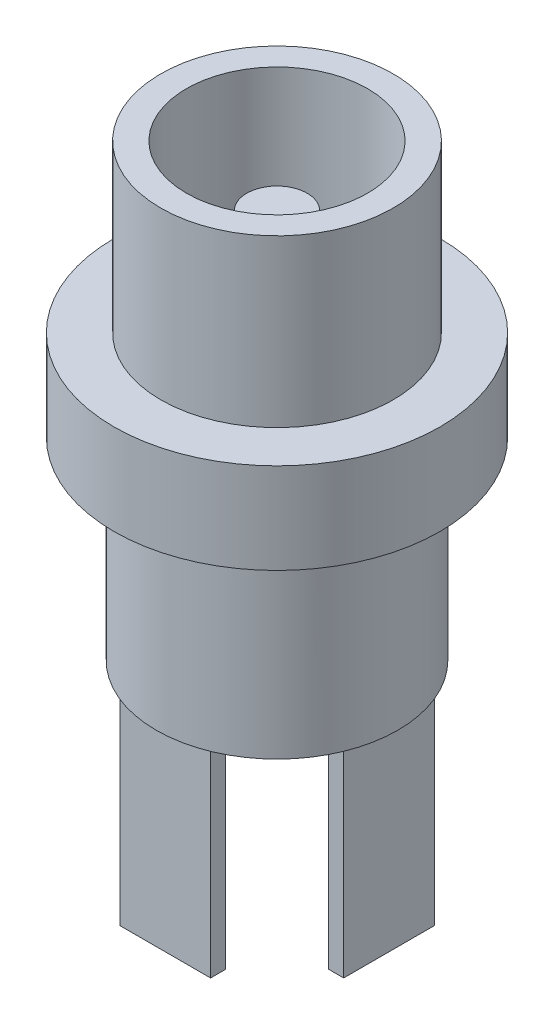
ISO-10303-21;
HEADER;
FILE_DESCRIPTION(('STEP AP214'),'2;1');
FILE_NAME('part.step','',(''),(''),'','','');
FILE_SCHEMA(('AUTOMOTIVE_DESIGN { 1 0 10303 214 1 1 1 1 }'));
ENDSEC;
DATA;
#1=APPLICATION_CONTEXT('core data for automotive mechanical design processes');
#2=APPLICATION_PROTOCOL_DEFINITION('international standard','automotive_design',2000,#1);
#3=PRODUCT_CONTEXT('',#1,'mechanical');
#4=PRODUCT('Part','Part','',(#3));
#5=PRODUCT_RELATED_PRODUCT_CATEGORY('part','',(#4));
#6=PRODUCT_DEFINITION_FORMATION('','',#4);
#7=PRODUCT_DEFINITION_CONTEXT('part definition',#1,'design');
#8=PRODUCT_DEFINITION('design','',#6,#7);
#9=PRODUCT_DEFINITION_SHAPE('','',#8);
#10=(LENGTH_UNIT() NAMED_UNIT(*) SI_UNIT(.MILLI.,.METRE.));
#11=(NAMED_UNIT(*) PLANE_ANGLE_UNIT() SI_UNIT($,.RADIAN.));
#12=(NAMED_UNIT(*) SI_UNIT($,.STERADIAN.) SOLID_ANGLE_UNIT());
#13=UNCERTAINTY_MEASURE_WITH_UNIT(LENGTH_MEASURE(1.E-05),#10,'distance_accuracy_value','');
#14=(GEOMETRIC_REPRESENTATION_CONTEXT(3) GLOBAL_UNCERTAINTY_ASSIGNED_CONTEXT((#13)) GLOBAL_UNIT_ASSIGNED_CONTEXT((#10,
#11,#12)) REPRESENTATION_CONTEXT('',''));
#15=CARTESIAN_POINT('',(0.,0.,0.));
#16=DIRECTION('',(0.,0.,1.));
#17=DIRECTION('',(1.,0.,0.));
#18=AXIS2_PLACEMENT_3D('',#15,#16,#17);
#19=CARTESIAN_POINT('',(0.,-1.5,0.));
#20=DIRECTION('',(0.,1.,0.));
#21=DIRECTION('',(0.,0.,1.));
#22=AXIS2_PLACEMENT_3D('',#19,#20,#21);
#23=PLANE('',#22);
#24=CARTESIAN_POINT('',(0.,-1.5,0.));
#25=DIRECTION('',(0.,1.,0.));
#26=DIRECTION('',(0.,0.,1.));
#27=AXIS2_PLACEMENT_3D('',#24,#25,#26);
#28=CIRCLE('',#27,3.);
#29=CARTESIAN_POINT('',(0.,-1.5,3.));
#30=VERTEX_POINT('',#29);
#31=EDGE_CURVE('E344',#30,#30,#28,.T.);
#32=ORIENTED_EDGE('',*,*,#31,.T.);
#33=EDGE_LOOP('',(#32));
#34=FACE_BOUND('',#33,.T.);
#35=CARTESIAN_POINT('',(0.,-1.5,0.));
#36=DIRECTION('',(0.,1.,0.));
#37=DIRECTION('',(0.,0.,1.));
#38=AXIS2_PLACEMENT_3D('',#35,#36,#37);
#39=CIRCLE('',#38,1.);
#40=CARTESIAN_POINT('',(0.,-1.5,1.));
#41=VERTEX_POINT('',#40);
#42=EDGE_CURVE('E352',#41,#41,#39,.T.);
#43=ORIENTED_EDGE('',*,*,#42,.F.);
#44=EDGE_LOOP('',(#43));
#45=FACE_BOUND('',#44,.T.);
#46=ADVANCED_FACE('F33',(#34,#45),#23,.T.);
#47=CARTESIAN_POINT('',(0.,-6.4,0.));
#48=DIRECTION('',(0.,-1.,0.));
#49=DIRECTION('',(0.,0.,-1.));
#50=AXIS2_PLACEMENT_3D('',#47,#48,#49);
#51=PLANE('',#50);
#52=CARTESIAN_POINT('',(0.,-6.4,0.));
#53=DIRECTION('',(0.,-1.,0.));
#54=DIRECTION('',(0.,0.,-1.));
#55=AXIS2_PLACEMENT_3D('',#52,#53,#54);
#56=CIRCLE('',#55,4.);
#57=CARTESIAN_POINT('',(3.70809924354783,-6.4,-1.5));
#58=VERTEX_POINT('',#57);
#59=CARTESIAN_POINT('',(3.70809924354783,-6.4,1.5));
#60=VERTEX_POINT('',#59);
#61=EDGE_CURVE('E209',#58,#60,#56,.T.);
#62=ORIENTED_EDGE('',*,*,#61,.T.);
#63=DIRECTION('',(0.,0.,1.));
#64=VECTOR('',#63,1.);
#65=CARTESIAN_POINT('',(3.70809924354783,-6.4,-1.5));
#66=LINE('',#65,#64);
#67=EDGE_CURVE('E146',#58,#60,#66,.T.);
#68=ORIENTED_EDGE('',*,*,#67,.F.);
#69=EDGE_LOOP('',(#62,#68));
#70=FACE_BOUND('',#69,.T.);
#71=ADVANCED_FACE('F250',(#70),#51,.T.);
#72=DIRECTION('',(0.,0.,-1.));
#73=VECTOR('',#72,1.);
#74=CARTESIAN_POINT('',(-1.49487014813232,-6.4,3.70360695690408));
#75=LINE('',#74,#73);
#76=CARTESIAN_POINT('',(-1.49487014813232,-6.4,3.70360695690408));
#77=VERTEX_POINT('',#76);
#78=CARTESIAN_POINT('',(-1.49487014813232,-6.4,3.20360695690408));
#79=VERTEX_POINT('',#78);
#80=EDGE_CURVE('E151',#77,#79,#75,.T.);
#81=ORIENTED_EDGE('',*,*,#80,.F.);
#82=DIRECTION('',(-1.,0.,0.));
#83=VECTOR('',#82,1.);
#84=CARTESIAN_POINT('',(-1.49487014813232,-6.4,3.70360695690408));
#85=LINE('',#84,#83);
#86=CARTESIAN_POINT('',(1.50512985186768,-6.4,3.70360695690408));
#87=VERTEX_POINT('',#86);
#88=EDGE_CURVE('E148',#87,#77,#85,.T.);
#89=ORIENTED_EDGE('',*,*,#88,.F.);
#90=DIRECTION('',(0.,0.,1.));
#91=VECTOR('',#90,1.);
#92=CARTESIAN_POINT('',(1.50512985186768,-6.4,3.70360695690408));
#93=LINE('',#92,#91);
#94=CARTESIAN_POINT('',(1.50512985186768,-6.4,3.20360695690408));
#95=VERTEX_POINT('',#94);
#96=EDGE_CURVE('E160',#95,#87,#93,.T.);
#97=ORIENTED_EDGE('',*,*,#96,.F.);
#98=DIRECTION('',(1.,0.,0.));
#99=VECTOR('',#98,1.);
#100=CARTESIAN_POINT('',(-1.49487014813232,-6.4,3.20360695690408));
#101=LINE('',#100,#99);
#102=EDGE_CURVE('E168',#79,#95,#101,.T.);
#103=ORIENTED_EDGE('',*,*,#102,.F.);
#104=EDGE_LOOP('',(#81,#89,#97,#103));
#105=FACE_BOUND('',#104,.T.);
#106=DIRECTION('',(1.,0.,0.));
#107=VECTOR('',#106,1.);
#108=CARTESIAN_POINT('',(-1.49487014813232,-6.4,-3.70360695690408));
#109=LINE('',#108,#107);
#110=CARTESIAN_POINT('',(-1.49487014813232,-6.4,-3.70360695690408));
#111=VERTEX_POINT('',#110);
#112=CARTESIAN_POINT('',(1.50512985186768,-6.4,-3.70360695690408));
#113=VERTEX_POINT('',#112);
#114=EDGE_CURVE('E193',#111,#113,#109,.T.);
#115=ORIENTED_EDGE('',*,*,#114,.F.);
#116=DIRECTION('',(0.,0.,-1.));
#117=VECTOR('',#116,1.);
#118=CARTESIAN_POINT('',(-1.49487014813232,-6.4,-3.70360695690408));
#119=LINE('',#118,#117);
#120=CARTESIAN_POINT('',(-1.49487014813232,-6.4,-3.20360695690408));
#121=VERTEX_POINT('',#120);
#122=EDGE_CURVE('E179',#121,#111,#119,.T.);
#123=ORIENTED_EDGE('',*,*,#122,.F.);
#124=DIRECTION('',(-1.,0.,0.));
#125=VECTOR('',#124,1.);
#126=CARTESIAN_POINT('',(-1.49487014813232,-6.4,-3.20360695690408));
#127=LINE('',#126,#125);
#128=CARTESIAN_POINT('',(1.50512985186768,-6.4,-3.20360695690408));
#129=VERTEX_POINT('',#128);
#130=EDGE_CURVE('E184',#129,#121,#127,.T.);
#131=ORIENTED_EDGE('',*,*,#130,.F.);
#132=DIRECTION('',(0.,0.,1.));
#133=VECTOR('',#132,1.);
#134=CARTESIAN_POINT('',(1.50512985186768,-6.4,-3.70360695690408));
#135=LINE('',#134,#133);
#136=EDGE_CURVE('E195',#113,#129,#135,.T.);
#137=ORIENTED_EDGE('',*,*,#136,.F.);
#138=EDGE_LOOP('',(#115,#123,#131,#137));
#139=FACE_BOUND('',#138,.T.);
#140=DIRECTION('',(0.,0.,-1.));
#141=VECTOR('',#140,1.);
#142=CARTESIAN_POINT('',(3.20809924354783,-6.4,-1.5));
#143=LINE('',#142,#141);
#144=CARTESIAN_POINT('',(3.20809924354783,-6.4,1.5));
#145=VERTEX_POINT('',#144);
#146=CARTESIAN_POINT('',(3.20809924354783,-6.4,-1.5));
#147=VERTEX_POINT('',#146);
#148=EDGE_CURVE('E332',#145,#147,#143,.T.);
#149=ORIENTED_EDGE('',*,*,#148,.F.);
#150=DIRECTION('',(-1.,0.,0.));
#151=VECTOR('',#150,1.);
#152=CARTESIAN_POINT('',(3.70809924354783,-6.4,1.5));
#153=LINE('',#152,#151);
#154=EDGE_CURVE('E334',#60,#145,#153,.T.);
#155=ORIENTED_EDGE('',*,*,#154,.F.);
#156=EDGE_CURVE('E208',#60,#58,#56,.T.);
#157=ORIENTED_EDGE('',*,*,#156,.T.);
#158=DIRECTION('',(1.,0.,0.));
#159=VECTOR('',#158,1.);
#160=CARTESIAN_POINT('',(3.70809924354783,-6.4,-1.5));
#161=LINE('',#160,#159);
#162=EDGE_CURVE('E142',#147,#58,#161,.T.);
#163=ORIENTED_EDGE('',*,*,#162,.F.);
#164=EDGE_LOOP('',(#149,#155,#157,#163));
#165=FACE_BOUND('',#164,.T.);
#166=ADVANCED_FACE('F228',(#105,#139,#165),#51,.T.);
#167=CARTESIAN_POINT('',(0.,0.,0.));
#168=DIRECTION('',(0.,1.,0.));
#169=DIRECTION('',(0.,0.,1.));
#170=AXIS2_PLACEMENT_3D('',#167,#168,#169);
#171=PLANE('',#170);
#172=CARTESIAN_POINT('',(0.,0.,0.));
#173=DIRECTION('',(0.,1.,0.));
#174=DIRECTION('',(0.,0.,1.));
#175=AXIS2_PLACEMENT_3D('',#172,#173,#174);
#176=CIRCLE('',#175,5.4);
#177=CARTESIAN_POINT('',(0.,0.,5.4));
#178=VERTEX_POINT('',#177);
#179=EDGE_CURVE('E216',#178,#178,#176,.T.);
#180=ORIENTED_EDGE('',*,*,#179,.F.);
#181=EDGE_LOOP('',(#180));
#182=FACE_BOUND('',#181,.T.);
#183=CARTESIAN_POINT('',(0.,0.,0.));
#184=DIRECTION('',(0.,1.,0.));
#185=DIRECTION('',(0.,0.,1.));
#186=AXIS2_PLACEMENT_3D('',#183,#184,#185);
#187=CIRCLE('',#186,4.);
#188=CARTESIAN_POINT('',(0.,0.,4.));
#189=VERTEX_POINT('',#188);
#190=EDGE_CURVE('E11',#189,#189,#187,.F.);
#191=ORIENTED_EDGE('',*,*,#190,.F.);
#192=EDGE_LOOP('',(#191));
#193=FACE_BOUND('',#192,.T.);
#194=ADVANCED_FACE('F224',(#182,#193),#171,.F.);
#195=CARTESIAN_POINT('',(0.,3.,0.));
#196=DIRECTION('',(0.,1.,0.));
#197=DIRECTION('',(0.,0.,1.));
#198=AXIS2_PLACEMENT_3D('',#195,#196,#197);
#199=PLANE('',#198);
#200=CARTESIAN_POINT('',(0.,3.,0.));
#201=DIRECTION('',(0.,1.,0.));
#202=DIRECTION('',(0.,0.,1.));
#203=AXIS2_PLACEMENT_3D('',#200,#201,#202);
#204=CIRCLE('',#203,5.4);
#205=CARTESIAN_POINT('',(0.,3.,5.4));
#206=VERTEX_POINT('',#205);
#207=EDGE_CURVE('E41',#206,#206,#204,.T.);
#208=ORIENTED_EDGE('',*,*,#207,.T.);
#209=EDGE_LOOP('',(#208));
#210=FACE_BOUND('',#209,.T.);
#211=CARTESIAN_POINT('',(0.,3.,0.));
#212=DIRECTION('',(0.,1.,0.));
#213=DIRECTION('',(0.,0.,1.));
#214=AXIS2_PLACEMENT_3D('',#211,#212,#213);
#215=CIRCLE('',#214,3.85);
#216=CARTESIAN_POINT('',(0.,3.,3.85));
#217=VERTEX_POINT('',#216);
#218=EDGE_CURVE('E212',#217,#217,#215,.T.);
#219=ORIENTED_EDGE('',*,*,#218,.F.);
#220=EDGE_LOOP('',(#219));
#221=FACE_BOUND('',#220,.T.);
#222=ADVANCED_FACE('F227',(#210,#221),#199,.T.);
#223=CARTESIAN_POINT('',(0.,3.,0.));
#224=DIRECTION('',(0.,-1.,0.));
#225=DIRECTION('',(0.,0.,-1.));
#226=AXIS2_PLACEMENT_3D('',#223,#224,#225);
#227=CYLINDRICAL_SURFACE('',#226,5.4);
#228=ORIENTED_EDGE('',*,*,#207,.F.);
#229=EDGE_LOOP('',(#228));
#230=FACE_BOUND('',#229,.T.);
#231=ORIENTED_EDGE('',*,*,#179,.T.);
#232=EDGE_LOOP('',(#231));
#233=FACE_BOUND('',#232,.T.);
#234=ADVANCED_FACE('F35',(#230,#233),#227,.T.);
#235=CARTESIAN_POINT('',(0.,8.5,0.));
#236=DIRECTION('',(0.,-1.,0.));
#237=DIRECTION('',(0.,0.,-1.));
#238=AXIS2_PLACEMENT_3D('',#235,#236,#237);
#239=CYLINDRICAL_SURFACE('',#238,3.85);
#240=CARTESIAN_POINT('',(0.,8.5,0.));
#241=DIRECTION('',(0.,1.,0.));
#242=DIRECTION('',(0.,0.,1.));
#243=AXIS2_PLACEMENT_3D('',#240,#241,#242);
#244=CIRCLE('',#243,3.85);
#245=CARTESIAN_POINT('',(0.,8.5,3.85));
#246=VERTEX_POINT('',#245);
#247=EDGE_CURVE('E213',#246,#246,#244,.T.);
#248=ORIENTED_EDGE('',*,*,#247,.F.);
#249=EDGE_LOOP('',(#248));
#250=FACE_BOUND('',#249,.T.);
#251=ORIENTED_EDGE('',*,*,#218,.T.);
#252=EDGE_LOOP('',(#251));
#253=FACE_BOUND('',#252,.T.);
#254=ADVANCED_FACE('F244',(#250,#253),#239,.T.);
#255=CARTESIAN_POINT('',(0.,8.5,0.));
#256=DIRECTION('',(0.,1.,0.));
#257=DIRECTION('',(0.,0.,1.));
#258=AXIS2_PLACEMENT_3D('',#255,#256,#257);
#259=PLANE('',#258);
#260=CARTESIAN_POINT('',(0.,8.5,0.));
#261=DIRECTION('',(0.,1.,0.));
#262=DIRECTION('',(0.,0.,1.));
#263=AXIS2_PLACEMENT_3D('',#260,#261,#262);
#264=CIRCLE('',#263,3.);
#265=CARTESIAN_POINT('',(0.,8.5,3.));
#266=VERTEX_POINT('',#265);
#267=EDGE_CURVE('E345',#266,#266,#264,.T.);
#268=ORIENTED_EDGE('',*,*,#267,.F.);
#269=EDGE_LOOP('',(#268));
#270=FACE_BOUND('',#269,.T.);
#271=ORIENTED_EDGE('',*,*,#247,.T.);
#272=EDGE_LOOP('',(#271));
#273=FACE_BOUND('',#272,.T.);
#274=ADVANCED_FACE('F234',(#270,#273),#259,.T.);
#275=CARTESIAN_POINT('',(0.,-6.4,0.));
#276=DIRECTION('',(0.,1.,0.));
#277=DIRECTION('',(0.,0.,1.));
#278=AXIS2_PLACEMENT_3D('',#275,#276,#277);
#279=CYLINDRICAL_SURFACE('',#278,4.);
#280=ORIENTED_EDGE('',*,*,#61,.F.);
#281=ORIENTED_EDGE('',*,*,#156,.F.);
#282=EDGE_LOOP('',(#280,#281));
#283=FACE_BOUND('',#282,.T.);
#284=ORIENTED_EDGE('',*,*,#190,.T.);
#285=EDGE_LOOP('',(#284));
#286=FACE_BOUND('',#285,.T.);
#287=ADVANCED_FACE('F231',(#283,#286),#279,.T.);
#288=CARTESIAN_POINT('',(-1.49487014813232,-12.9,-3.70360695690408));
#289=DIRECTION('',(1.,0.,0.));
#290=DIRECTION('',(0.,0.,-1.));
#291=AXIS2_PLACEMENT_3D('',#288,#289,#290);
#292=PLANE('',#291);
#293=ORIENTED_EDGE('',*,*,#122,.T.);
#294=DIRECTION('',(0.,1.,0.));
#295=VECTOR('',#294,1.);
#296=CARTESIAN_POINT('',(-1.49487014813232,-12.9,-3.70360695690408));
#297=LINE('',#296,#295);
#298=CARTESIAN_POINT('',(-1.49487014813232,-12.9,-3.70360695690408));
#299=VERTEX_POINT('',#298);
#300=EDGE_CURVE('E206',#299,#111,#297,.T.);
#301=ORIENTED_EDGE('',*,*,#300,.F.);
#302=DIRECTION('',(0.,0.,-1.));
#303=VECTOR('',#302,1.);
#304=CARTESIAN_POINT('',(-1.49487014813232,-12.9,-3.70360695690408));
#305=LINE('',#304,#303);
#306=CARTESIAN_POINT('',(-1.49487014813232,-12.9,-3.20360695690408));
#307=VERTEX_POINT('',#306);
#308=EDGE_CURVE('E180',#307,#299,#305,.T.);
#309=ORIENTED_EDGE('',*,*,#308,.F.);
#310=DIRECTION('',(0.,1.,0.));
#311=VECTOR('',#310,1.);
#312=CARTESIAN_POINT('',(-1.49487014813232,-12.9,-3.20360695690408));
#313=LINE('',#312,#311);
#314=EDGE_CURVE('E190',#307,#121,#313,.T.);
#315=ORIENTED_EDGE('',*,*,#314,.T.);
#316=EDGE_LOOP('',(#293,#301,#309,#315));
#317=FACE_BOUND('',#316,.T.);
#318=ADVANCED_FACE('F233',(#317),#292,.F.);
#319=CARTESIAN_POINT('',(-1.49487014813232,-12.9,-3.70360695690408));
#320=DIRECTION('',(0.,0.,1.));
#321=DIRECTION('',(1.,0.,0.));
#322=AXIS2_PLACEMENT_3D('',#319,#320,#321);
#323=PLANE('',#322);
#324=ORIENTED_EDGE('',*,*,#114,.T.);
#325=DIRECTION('',(0.,1.,0.));
#326=VECTOR('',#325,1.);
#327=CARTESIAN_POINT('',(1.50512985186768,-12.9,-3.70360695690408));
#328=LINE('',#327,#326);
#329=CARTESIAN_POINT('',(1.50512985186768,-12.9,-3.70360695690408));
#330=VERTEX_POINT('',#329);
#331=EDGE_CURVE('E203',#330,#113,#328,.T.);
#332=ORIENTED_EDGE('',*,*,#331,.F.);
#333=DIRECTION('',(1.,0.,0.));
#334=VECTOR('',#333,1.);
#335=CARTESIAN_POINT('',(-1.49487014813232,-12.9,-3.70360695690408));
#336=LINE('',#335,#334);
#337=EDGE_CURVE('E183',#299,#330,#336,.T.);
#338=ORIENTED_EDGE('',*,*,#337,.F.);
#339=ORIENTED_EDGE('',*,*,#300,.T.);
#340=EDGE_LOOP('',(#324,#332,#338,#339));
#341=FACE_BOUND('',#340,.T.);
#342=ADVANCED_FACE('F241',(#341),#323,.F.);
#343=CARTESIAN_POINT('',(1.50512985186768,-12.9,-3.70360695690408));
#344=DIRECTION('',(-1.,0.,0.));
#345=DIRECTION('',(0.,0.,1.));
#346=AXIS2_PLACEMENT_3D('',#343,#344,#345);
#347=PLANE('',#346);
#348=ORIENTED_EDGE('',*,*,#136,.T.);
#349=DIRECTION('',(0.,1.,0.));
#350=VECTOR('',#349,1.);
#351=CARTESIAN_POINT('',(1.50512985186768,-12.9,-3.20360695690408));
#352=LINE('',#351,#350);
#353=CARTESIAN_POINT('',(1.50512985186768,-12.9,-3.20360695690408));
#354=VERTEX_POINT('',#353);
#355=EDGE_CURVE('E201',#354,#129,#352,.T.);
#356=ORIENTED_EDGE('',*,*,#355,.F.);
#357=DIRECTION('',(0.,0.,1.));
#358=VECTOR('',#357,1.);
#359=CARTESIAN_POINT('',(1.50512985186768,-12.9,-3.70360695690408));
#360=LINE('',#359,#358);
#361=EDGE_CURVE('E186',#330,#354,#360,.T.);
#362=ORIENTED_EDGE('',*,*,#361,.F.);
#363=ORIENTED_EDGE('',*,*,#331,.T.);
#364=EDGE_LOOP('',(#348,#356,#362,#363));
#365=FACE_BOUND('',#364,.T.);
#366=ADVANCED_FACE('F306',(#365),#347,.F.);
#367=CARTESIAN_POINT('',(-1.49487014813232,-12.9,-3.20360695690408));
#368=DIRECTION('',(0.,0.,-1.));
#369=DIRECTION('',(-1.,0.,0.));
#370=AXIS2_PLACEMENT_3D('',#367,#368,#369);
#371=PLANE('',#370);
#372=ORIENTED_EDGE('',*,*,#130,.T.);
#373=ORIENTED_EDGE('',*,*,#314,.F.);
#374=DIRECTION('',(-1.,0.,0.));
#375=VECTOR('',#374,1.);
#376=CARTESIAN_POINT('',(-1.49487014813232,-12.9,-3.20360695690408));
#377=LINE('',#376,#375);
#378=EDGE_CURVE('E188',#354,#307,#377,.T.);
#379=ORIENTED_EDGE('',*,*,#378,.F.);
#380=ORIENTED_EDGE('',*,*,#355,.T.);
#381=EDGE_LOOP('',(#372,#373,#379,#380));
#382=FACE_BOUND('',#381,.T.);
#383=ADVANCED_FACE('F302',(#382),#371,.F.);
#384=CARTESIAN_POINT('',(0.,-12.9,0.));
#385=DIRECTION('',(0.,1.,0.));
#386=DIRECTION('',(0.,0.,1.));
#387=AXIS2_PLACEMENT_3D('',#384,#385,#386);
#388=PLANE('',#387);
#389=ORIENTED_EDGE('',*,*,#308,.T.);
#390=ORIENTED_EDGE('',*,*,#337,.T.);
#391=ORIENTED_EDGE('',*,*,#361,.T.);
#392=ORIENTED_EDGE('',*,*,#378,.T.);
#393=EDGE_LOOP('',(#389,#390,#391,#392));
#394=FACE_BOUND('',#393,.T.);
#395=ADVANCED_FACE('F298',(#394),#388,.F.);
#396=CARTESIAN_POINT('',(-1.49487014813232,-12.9,3.70360695690408));
#397=DIRECTION('',(0.,0.,-1.));
#398=DIRECTION('',(-1.,0.,0.));
#399=AXIS2_PLACEMENT_3D('',#396,#397,#398);
#400=PLANE('',#399);
#401=ORIENTED_EDGE('',*,*,#88,.T.);
#402=DIRECTION('',(0.,1.,0.));
#403=VECTOR('',#402,1.);
#404=CARTESIAN_POINT('',(-1.49487014813232,-12.9,3.70360695690408));
#405=LINE('',#404,#403);
#406=CARTESIAN_POINT('',(-1.49487014813232,-12.9,3.70360695690408));
#407=VERTEX_POINT('',#406);
#408=EDGE_CURVE('E177',#407,#77,#405,.T.);
#409=ORIENTED_EDGE('',*,*,#408,.F.);
#410=DIRECTION('',(-1.,0.,0.));
#411=VECTOR('',#410,1.);
#412=CARTESIAN_POINT('',(-1.49487014813232,-12.9,3.70360695690408));
#413=LINE('',#412,#411);
#414=CARTESIAN_POINT('',(1.50512985186768,-12.9,3.70360695690408));
#415=VERTEX_POINT('',#414);
#416=EDGE_CURVE('E156',#415,#407,#413,.T.);
#417=ORIENTED_EDGE('',*,*,#416,.F.);
#418=DIRECTION('',(0.,1.,0.));
#419=VECTOR('',#418,1.);
#420=CARTESIAN_POINT('',(1.50512985186768,-12.9,3.70360695690408));
#421=LINE('',#420,#419);
#422=EDGE_CURVE('E165',#415,#87,#421,.T.);
#423=ORIENTED_EDGE('',*,*,#422,.T.);
#424=EDGE_LOOP('',(#401,#409,#417,#423));
#425=FACE_BOUND('',#424,.T.);
#426=ADVANCED_FACE('F294',(#425),#400,.F.);
#427=CARTESIAN_POINT('',(-1.49487014813232,-12.9,3.70360695690408));
#428=DIRECTION('',(1.,0.,0.));
#429=DIRECTION('',(0.,0.,-1.));
#430=AXIS2_PLACEMENT_3D('',#427,#428,#429);
#431=PLANE('',#430);
#432=ORIENTED_EDGE('',*,*,#80,.T.);
#433=DIRECTION('',(0.,1.,0.));
#434=VECTOR('',#433,1.);
#435=CARTESIAN_POINT('',(-1.49487014813232,-12.9,3.20360695690408));
#436=LINE('',#435,#434);
#437=CARTESIAN_POINT('',(-1.49487014813232,-12.9,3.20360695690408));
#438=VERTEX_POINT('',#437);
#439=EDGE_CURVE('E174',#438,#79,#436,.T.);
#440=ORIENTED_EDGE('',*,*,#439,.F.);
#441=DIRECTION('',(0.,0.,-1.));
#442=VECTOR('',#441,1.);
#443=CARTESIAN_POINT('',(-1.49487014813232,-12.9,3.70360695690408));
#444=LINE('',#443,#442);
#445=EDGE_CURVE('E159',#407,#438,#444,.T.);
#446=ORIENTED_EDGE('',*,*,#445,.F.);
#447=ORIENTED_EDGE('',*,*,#408,.T.);
#448=EDGE_LOOP('',(#432,#440,#446,#447));
#449=FACE_BOUND('',#448,.T.);
#450=ADVANCED_FACE('F290',(#449),#431,.F.);
#451=CARTESIAN_POINT('',(-1.49487014813232,-12.9,3.20360695690408));
#452=DIRECTION('',(0.,0.,1.));
#453=DIRECTION('',(1.,0.,0.));
#454=AXIS2_PLACEMENT_3D('',#451,#452,#453);
#455=PLANE('',#454);
#456=ORIENTED_EDGE('',*,*,#102,.T.);
#457=DIRECTION('',(0.,1.,0.));
#458=VECTOR('',#457,1.);
#459=CARTESIAN_POINT('',(1.50512985186768,-12.9,3.20360695690408));
#460=LINE('',#459,#458);
#461=CARTESIAN_POINT('',(1.50512985186768,-12.9,3.20360695690408));
#462=VERTEX_POINT('',#461);
#463=EDGE_CURVE('E56',#462,#95,#460,.T.);
#464=ORIENTED_EDGE('',*,*,#463,.F.);
#465=DIRECTION('',(1.,0.,0.));
#466=VECTOR('',#465,1.);
#467=CARTESIAN_POINT('',(-1.49487014813232,-12.9,3.20360695690408));
#468=LINE('',#467,#466);
#469=EDGE_CURVE('E162',#438,#462,#468,.T.);
#470=ORIENTED_EDGE('',*,*,#469,.F.);
#471=ORIENTED_EDGE('',*,*,#439,.T.);
#472=EDGE_LOOP('',(#456,#464,#470,#471));
#473=FACE_BOUND('',#472,.T.);
#474=ADVANCED_FACE('F287',(#473),#455,.F.);
#475=CARTESIAN_POINT('',(1.50512985186768,-12.9,3.70360695690408));
#476=DIRECTION('',(-1.,0.,0.));
#477=DIRECTION('',(0.,0.,1.));
#478=AXIS2_PLACEMENT_3D('',#475,#476,#477);
#479=PLANE('',#478);
#480=ORIENTED_EDGE('',*,*,#96,.T.);
#481=ORIENTED_EDGE('',*,*,#422,.F.);
#482=DIRECTION('',(0.,0.,1.));
#483=VECTOR('',#482,1.);
#484=CARTESIAN_POINT('',(1.50512985186768,-12.9,3.70360695690408));
#485=LINE('',#484,#483);
#486=EDGE_CURVE('E164',#462,#415,#485,.T.);
#487=ORIENTED_EDGE('',*,*,#486,.F.);
#488=ORIENTED_EDGE('',*,*,#463,.T.);
#489=EDGE_LOOP('',(#480,#481,#487,#488));
#490=FACE_BOUND('',#489,.T.);
#491=ADVANCED_FACE('F283',(#490),#479,.F.);
#492=CARTESIAN_POINT('',(0.,-12.9,0.));
#493=DIRECTION('',(0.,1.,0.));
#494=DIRECTION('',(0.,0.,1.));
#495=AXIS2_PLACEMENT_3D('',#492,#493,#494);
#496=PLANE('',#495);
#497=ORIENTED_EDGE('',*,*,#416,.T.);
#498=ORIENTED_EDGE('',*,*,#445,.T.);
#499=ORIENTED_EDGE('',*,*,#469,.T.);
#500=ORIENTED_EDGE('',*,*,#486,.T.);
#501=EDGE_LOOP('',(#497,#498,#499,#500));
#502=FACE_BOUND('',#501,.T.);
#503=ADVANCED_FACE('F280',(#502),#496,.F.);
#504=CARTESIAN_POINT('',(3.70809924354783,-12.9,-1.5));
#505=DIRECTION('',(-1.,0.,0.));
#506=DIRECTION('',(0.,0.,1.));
#507=AXIS2_PLACEMENT_3D('',#504,#505,#506);
#508=PLANE('',#507);
#509=ORIENTED_EDGE('',*,*,#67,.T.);
#510=DIRECTION('',(0.,1.,0.));
#511=VECTOR('',#510,1.);
#512=CARTESIAN_POINT('',(3.70809924354783,-12.9,1.5));
#513=LINE('',#512,#511);
#514=CARTESIAN_POINT('',(3.70809924354783,-12.9,1.5));
#515=VERTEX_POINT('',#514);
#516=EDGE_CURVE('E127',#515,#60,#513,.T.);
#517=ORIENTED_EDGE('',*,*,#516,.F.);
#518=DIRECTION('',(0.,0.,1.));
#519=VECTOR('',#518,1.);
#520=CARTESIAN_POINT('',(3.70809924354783,-12.9,-1.5));
#521=LINE('',#520,#519);
#522=CARTESIAN_POINT('',(3.70809924354783,-12.9,-1.5));
#523=VERTEX_POINT('',#522);
#524=EDGE_CURVE('E134',#523,#515,#521,.T.);
#525=ORIENTED_EDGE('',*,*,#524,.F.);
#526=DIRECTION('',(0.,1.,0.));
#527=VECTOR('',#526,1.);
#528=CARTESIAN_POINT('',(3.70809924354783,-12.9,-1.5));
#529=LINE('',#528,#527);
#530=EDGE_CURVE('E341',#523,#58,#529,.T.);
#531=ORIENTED_EDGE('',*,*,#530,.T.);
#532=EDGE_LOOP('',(#509,#517,#525,#531));
#533=FACE_BOUND('',#532,.T.);
#534=ADVANCED_FACE('F144',(#533),#508,.F.);
#535=CARTESIAN_POINT('',(3.70809924354783,-12.9,1.5));
#536=DIRECTION('',(0.,0.,-1.));
#537=DIRECTION('',(-1.,0.,0.));
#538=AXIS2_PLACEMENT_3D('',#535,#536,#537);
#539=PLANE('',#538);
#540=ORIENTED_EDGE('',*,*,#154,.T.);
#541=DIRECTION('',(0.,1.,0.));
#542=VECTOR('',#541,1.);
#543=CARTESIAN_POINT('',(3.20809924354783,-12.9,1.5));
#544=LINE('',#543,#542);
#545=CARTESIAN_POINT('',(3.20809924354783,-12.9,1.5));
#546=VERTEX_POINT('',#545);
#547=EDGE_CURVE('E130',#546,#145,#544,.T.);
#548=ORIENTED_EDGE('',*,*,#547,.F.);
#549=DIRECTION('',(-1.,0.,0.));
#550=VECTOR('',#549,1.);
#551=CARTESIAN_POINT('',(3.70809924354783,-12.9,1.5));
#552=LINE('',#551,#550);
#553=EDGE_CURVE('E123',#515,#546,#552,.T.);
#554=ORIENTED_EDGE('',*,*,#553,.F.);
#555=ORIENTED_EDGE('',*,*,#516,.T.);
#556=EDGE_LOOP('',(#540,#548,#554,#555));
#557=FACE_BOUND('',#556,.T.);
#558=ADVANCED_FACE('F125',(#557),#539,.F.);
#559=CARTESIAN_POINT('',(3.20809924354783,-12.9,-1.5));
#560=DIRECTION('',(1.,0.,0.));
#561=DIRECTION('',(0.,0.,-1.));
#562=AXIS2_PLACEMENT_3D('',#559,#560,#561);
#563=PLANE('',#562);
#564=ORIENTED_EDGE('',*,*,#148,.T.);
#565=DIRECTION('',(0.,1.,0.));
#566=VECTOR('',#565,1.);
#567=CARTESIAN_POINT('',(3.20809924354783,-12.9,-1.5));
#568=LINE('',#567,#566);
#569=CARTESIAN_POINT('',(3.20809924354783,-12.9,-1.5));
#570=VERTEX_POINT('',#569);
#571=EDGE_CURVE('E48',#570,#147,#568,.T.);
#572=ORIENTED_EDGE('',*,*,#571,.F.);
#573=DIRECTION('',(0.,0.,-1.));
#574=VECTOR('',#573,1.);
#575=CARTESIAN_POINT('',(3.20809924354783,-12.9,-1.5));
#576=LINE('',#575,#574);
#577=EDGE_CURVE('E133',#546,#570,#576,.T.);
#578=ORIENTED_EDGE('',*,*,#577,.F.);
#579=ORIENTED_EDGE('',*,*,#547,.T.);
#580=EDGE_LOOP('',(#564,#572,#578,#579));
#581=FACE_BOUND('',#580,.T.);
#582=ADVANCED_FACE('F272',(#581),#563,.F.);
#583=CARTESIAN_POINT('',(3.70809924354783,-12.9,-1.5));
#584=DIRECTION('',(0.,0.,1.));
#585=DIRECTION('',(1.,0.,0.));
#586=AXIS2_PLACEMENT_3D('',#583,#584,#585);
#587=PLANE('',#586);
#588=ORIENTED_EDGE('',*,*,#162,.T.);
#589=ORIENTED_EDGE('',*,*,#530,.F.);
#590=DIRECTION('',(1.,0.,0.));
#591=VECTOR('',#590,1.);
#592=CARTESIAN_POINT('',(3.70809924354783,-12.9,-1.5));
#593=LINE('',#592,#591);
#594=EDGE_CURVE('E138',#570,#523,#593,.T.);
#595=ORIENTED_EDGE('',*,*,#594,.F.);
#596=ORIENTED_EDGE('',*,*,#571,.T.);
#597=EDGE_LOOP('',(#588,#589,#595,#596));
#598=FACE_BOUND('',#597,.T.);
#599=ADVANCED_FACE('F269',(#598),#587,.F.);
#600=CARTESIAN_POINT('',(0.,-12.9,0.));
#601=DIRECTION('',(0.,-1.,0.));
#602=DIRECTION('',(0.,0.,-1.));
#603=AXIS2_PLACEMENT_3D('',#600,#601,#602);
#604=PLANE('',#603);
#605=ORIENTED_EDGE('',*,*,#524,.T.);
#606=ORIENTED_EDGE('',*,*,#553,.T.);
#607=ORIENTED_EDGE('',*,*,#577,.T.);
#608=ORIENTED_EDGE('',*,*,#594,.T.);
#609=EDGE_LOOP('',(#605,#606,#607,#608));
#610=FACE_BOUND('',#609,.T.);
#611=ADVANCED_FACE('F137',(#610),#604,.T.);
#612=CARTESIAN_POINT('',(0.,-1.5,0.));
#613=DIRECTION('',(0.,1.,0.));
#614=DIRECTION('',(0.,0.,1.));
#615=AXIS2_PLACEMENT_3D('',#612,#613,#614);
#616=CYLINDRICAL_SURFACE('',#615,3.);
#617=ORIENTED_EDGE('',*,*,#31,.F.);
#618=EDGE_LOOP('',(#617));
#619=FACE_BOUND('',#618,.T.);
#620=ORIENTED_EDGE('',*,*,#267,.T.);
#621=EDGE_LOOP('',(#620));
#622=FACE_BOUND('',#621,.T.);
#623=ADVANCED_FACE('F263',(#619,#622),#616,.F.);
#624=CARTESIAN_POINT('',(0.,6.5,0.));
#625=DIRECTION('',(0.,-1.,0.));
#626=DIRECTION('',(0.,0.,-1.));
#627=AXIS2_PLACEMENT_3D('',#624,#625,#626);
#628=CYLINDRICAL_SURFACE('',#627,1.);
#629=CARTESIAN_POINT('',(0.,6.5,0.));
#630=DIRECTION('',(0.,1.,0.));
#631=DIRECTION('',(0.,0.,1.));
#632=AXIS2_PLACEMENT_3D('',#629,#630,#631);
#633=CIRCLE('',#632,1.);
#634=CARTESIAN_POINT('',(0.,6.5,1.));
#635=VERTEX_POINT('',#634);
#636=EDGE_CURVE('E349',#635,#635,#633,.T.);
#637=ORIENTED_EDGE('',*,*,#636,.F.);
#638=EDGE_LOOP('',(#637));
#639=FACE_BOUND('',#638,.T.);
#640=ORIENTED_EDGE('',*,*,#42,.T.);
#641=EDGE_LOOP('',(#640));
#642=FACE_BOUND('',#641,.T.);
#643=ADVANCED_FACE('F261',(#639,#642),#628,.T.);
#644=CARTESIAN_POINT('',(0.,6.5,0.));
#645=DIRECTION('',(0.,1.,0.));
#646=DIRECTION('',(0.,0.,1.));
#647=AXIS2_PLACEMENT_3D('',#644,#645,#646);
#648=PLANE('',#647);
#649=ORIENTED_EDGE('',*,*,#636,.T.);
#650=EDGE_LOOP('',(#649));
#651=FACE_BOUND('',#650,.T.);
#652=ADVANCED_FACE('F358',(#651),#648,.T.);
#653=CLOSED_SHELL('',(#46,#71,#166,#194,#222,#234,#254,#274,#287,#318,#342,#366,#383,#395,#426,
#450,#474,#491,#503,#534,#558,#582,#599,#611,#623,#643,#652));
#654=MANIFOLD_SOLID_BREP('B2',#653);
#655=ADVANCED_BREP_SHAPE_REPRESENTATION('',(#18,#654),#14);
#656=SHAPE_DEFINITION_REPRESENTATION(#9,#655);
ENDSEC;
END-ISO-10303-21;
